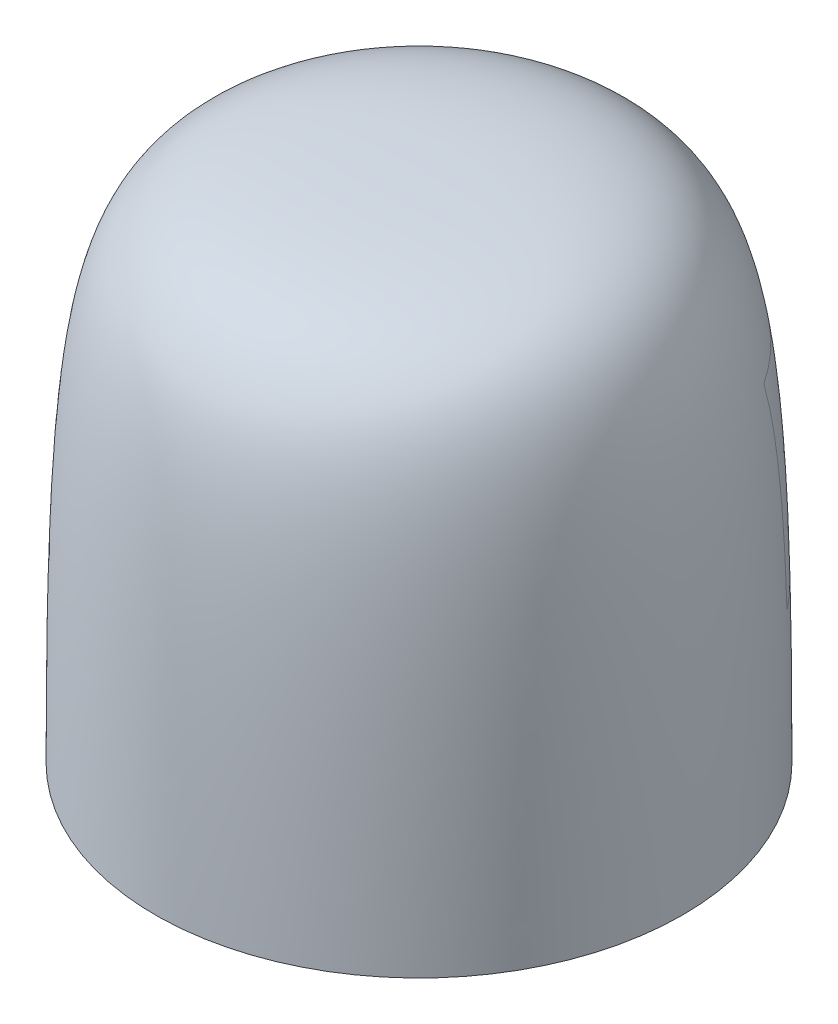
ISO-10303-21;
HEADER;
FILE_DESCRIPTION(('STEP AP214'),'2;1');
FILE_NAME('part.step','',(''),(''),'','','');
FILE_SCHEMA(('AUTOMOTIVE_DESIGN { 1 0 10303 214 1 1 1 1 }'));
ENDSEC;
DATA;
#1=APPLICATION_CONTEXT('core data for automotive mechanical design processes');
#2=APPLICATION_PROTOCOL_DEFINITION('international standard','automotive_design',2000,#1);
#3=PRODUCT_CONTEXT('',#1,'mechanical');
#4=PRODUCT('Part','Part','',(#3));
#5=PRODUCT_RELATED_PRODUCT_CATEGORY('part','',(#4));
#6=PRODUCT_DEFINITION_FORMATION('','',#4);
#7=PRODUCT_DEFINITION_CONTEXT('part definition',#1,'design');
#8=PRODUCT_DEFINITION('design','',#6,#7);
#9=PRODUCT_DEFINITION_SHAPE('','',#8);
#10=(LENGTH_UNIT() NAMED_UNIT(*) SI_UNIT(.MILLI.,.METRE.));
#11=(NAMED_UNIT(*) PLANE_ANGLE_UNIT() SI_UNIT($,.RADIAN.));
#12=(NAMED_UNIT(*) SI_UNIT($,.STERADIAN.) SOLID_ANGLE_UNIT());
#13=UNCERTAINTY_MEASURE_WITH_UNIT(LENGTH_MEASURE(1.E-05),#10,'distance_accuracy_value','');
#14=(GEOMETRIC_REPRESENTATION_CONTEXT(3) GLOBAL_UNCERTAINTY_ASSIGNED_CONTEXT((#13)) GLOBAL_UNIT_ASSIGNED_CONTEXT((#10,
#11,#12)) REPRESENTATION_CONTEXT('',''));
#15=CARTESIAN_POINT('',(0.,0.,0.));
#16=DIRECTION('',(0.,0.,1.));
#17=DIRECTION('',(1.,0.,0.));
#18=AXIS2_PLACEMENT_3D('',#15,#16,#17);
#19=CARTESIAN_POINT('',(0.,50.,0.));
#20=CARTESIAN_POINT('',(25.4,50.,0.));
#21=CARTESIAN_POINT('',(25.4,0.,0.));
#22=(BOUNDED_CURVE() B_SPLINE_CURVE(2,(#19,#20,#21),.UNSPECIFIED.,.F.,
.F.) B_SPLINE_CURVE_WITH_KNOTS((3,3),(0.,1.),
.UNSPECIFIED.) CURVE() GEOMETRIC_REPRESENTATION_ITEM() RATIONAL_B_SPLINE_CURVE((1.,
2.47502696889571,1.)) REPRESENTATION_ITEM(''));
#23=CARTESIAN_POINT('',(0.,0.,0.));
#24=DIRECTION('',(0.,-1.,0.));
#25=AXIS1_PLACEMENT('',#23,#24);
#26=SURFACE_OF_REVOLUTION('',#22,#25);
#27=CARTESIAN_POINT('',(0.,50.,0.));
#28=VERTEX_POINT('',#27);
#29=VERTEX_LOOP('',#28);
#30=FACE_BOUND('',#29,.T.);
#31=CARTESIAN_POINT('',(0.,0.,0.));
#32=DIRECTION('',(0.,-1.,0.));
#33=DIRECTION('',(0.,0.,-1.));
#34=AXIS2_PLACEMENT_3D('',#31,#32,#33);
#35=CIRCLE('',#34,25.4);
#36=CARTESIAN_POINT('',(0.,0.,-25.4));
#37=VERTEX_POINT('',#36);
#38=EDGE_CURVE('E78',#37,#37,#35,.T.);
#39=ORIENTED_EDGE('',*,*,#38,.F.);
#40=EDGE_LOOP('',(#39));
#41=FACE_BOUND('',#40,.T.);
#42=CARTESIAN_POINT('',(-20.,15.,-15.4477518705126));
#43=CARTESIAN_POINT('',(-20.,15.5609498129172,-15.4289699253339));
#44=CARTESIAN_POINT('',(-20.,16.12184793648,-15.4085168354005));
#45=CARTESIAN_POINT('',(-20.,17.2428887497305,-15.363715607829));
#46=CARTESIAN_POINT('',(-20.,17.8030316070898,-15.3393716477059));
#47=CARTESIAN_POINT('',(-20.,18.9225318494632,-15.2862255977604));
#48=CARTESIAN_POINT('',(-20.,19.4818894506108,-15.2574281089941));
#49=CARTESIAN_POINT('',(-20.,20.5997780633631,-15.1946581198859));
#50=CARTESIAN_POINT('',(-20.,21.1583093530604,-15.1606906125982));
#51=CARTESIAN_POINT('',(-20.,22.2744965185269,-15.0867082642588));
#52=CARTESIAN_POINT('',(-20.,22.832152734656,-15.0466986043845));
#53=CARTESIAN_POINT('',(-20.,23.9465295536007,-14.9595452004597));
#54=CARTESIAN_POINT('',(-20.,24.503250535296,-14.9124063475008));
#55=CARTESIAN_POINT('',(-20.,25.6168674482468,-14.8095169735343));
#56=CARTESIAN_POINT('',(-20.,26.1737620398988,-14.7537518114479));
#57=CARTESIAN_POINT('',(-20.,27.2863912345675,-14.631929154367));
#58=CARTESIAN_POINT('',(-20.,27.8421259300257,-14.5658725140112));
#59=CARTESIAN_POINT('',(-20.,28.9520661288805,-14.4212117672557));
#60=CARTESIAN_POINT('',(-20.,29.506271370047,-14.3426056305133));
#61=CARTESIAN_POINT('',(-20.,30.6127064402216,-14.1698937749335));
#62=CARTESIAN_POINT('',(-20.,31.1649346272592,-14.0757773142097));
#63=CARTESIAN_POINT('',(-20.,31.9910432409819,-13.9200327282164));
#64=CARTESIAN_POINT('',(-20.,32.2662911565409,-13.8656331229772));
#65=CARTESIAN_POINT('',(-20.,32.815646017204,-13.7513846928676));
#66=CARTESIAN_POINT('',(-20.,33.0897530141545,-13.6915361185041));
#67=CARTESIAN_POINT('',(-20.,33.6376055822142,-13.5654816016977));
#68=CARTESIAN_POINT('',(-20.,33.9113458341175,-13.4992523952278));
#69=CARTESIAN_POINT('',(-20.,34.4570847899595,-13.3598077295058));
#70=CARTESIAN_POINT('',(-20.,34.7290832025725,-13.2865911325676));
#71=CARTESIAN_POINT('',(-20.,35.,-13.209480899361));
#72=B_SPLINE_CURVE_WITH_KNOTS('',3,(#42,#43,#44,#45,#46,#47,#48,#49,#50,#51,#52,#53,#54,#55,#56,
#57,#58,#59,#60,#61,#62,#63,#64,#65,#66,#67,#68,#69,#70,#71),.UNSPECIFIED.,.F.,.F.,(4,2,2,2,2,2,
2,2,2,2,2,2,2,2,4),(0.,1.68379632077419,3.36579679457697,5.04607101774457,6.72473265846417,
8.40196292690612,10.0780476825357,11.7570090487128,13.4358310625781,15.1149249634185,
16.7951866686561,17.636858145567,18.4784909476178,19.3233177113435,20.1682822651077),.UNSPECIFIED.);
#73=CARTESIAN_POINT('',(-20.,15.,-15.4477518705126));
#74=VERTEX_POINT('',#73);
#75=CARTESIAN_POINT('',(-20.,35.,-13.209480899361));
#76=VERTEX_POINT('',#75);
#77=EDGE_CURVE('E11',#74,#76,#72,.T.);
#78=ORIENTED_EDGE('',*,*,#77,.F.);
#79=CARTESIAN_POINT('',(0.,15.,0.));
#80=DIRECTION('',(0.,-1.,0.));
#81=DIRECTION('',(0.,0.,-1.));
#82=AXIS2_PLACEMENT_3D('',#79,#80,#81);
#83=CIRCLE('',#82,25.2711898780593);
#84=CARTESIAN_POINT('',(20.,15.,-15.4477518705125));
#85=VERTEX_POINT('',#84);
#86=EDGE_CURVE('E98',#74,#85,#83,.T.);
#87=ORIENTED_EDGE('',*,*,#86,.T.);
#88=CARTESIAN_POINT('',(20.,15.,-15.4477518705125));
#89=CARTESIAN_POINT('',(20.,15.5609498129172,-15.4289699253338));
#90=CARTESIAN_POINT('',(20.,16.12184793648,-15.4085168354005));
#91=CARTESIAN_POINT('',(20.,17.2428887497305,-15.363715607829));
#92=CARTESIAN_POINT('',(20.,17.8030316070898,-15.3393716477059));
#93=CARTESIAN_POINT('',(20.,18.9225318494632,-15.2862255977604));
#94=CARTESIAN_POINT('',(20.,19.4818894506109,-15.2574281089941));
#95=CARTESIAN_POINT('',(20.,20.5997780633631,-15.1946581198859));
#96=CARTESIAN_POINT('',(20.,21.1583093530604,-15.1606906125982));
#97=CARTESIAN_POINT('',(20.,22.274496518527,-15.0867082642588));
#98=CARTESIAN_POINT('',(20.,22.8321527346561,-15.0466986043845));
#99=CARTESIAN_POINT('',(20.,23.9465295536007,-14.9595452004597));
#100=CARTESIAN_POINT('',(20.,24.503250535296,-14.9124063475008));
#101=CARTESIAN_POINT('',(20.,25.6168674482468,-14.8095169735343));
#102=CARTESIAN_POINT('',(20.,26.1737620398989,-14.7537518114479));
#103=CARTESIAN_POINT('',(20.,27.2863912345675,-14.631929154367));
#104=CARTESIAN_POINT('',(20.,27.8421259300257,-14.5658725140112));
#105=CARTESIAN_POINT('',(20.,28.9520661288806,-14.4212117672557));
#106=CARTESIAN_POINT('',(20.,29.506271370047,-14.3426056305133));
#107=CARTESIAN_POINT('',(20.,30.6127064402217,-14.1698937749335));
#108=CARTESIAN_POINT('',(20.,31.1649346272593,-14.0757773142097));
#109=CARTESIAN_POINT('',(20.,31.991043240982,-13.9200327282164));
#110=CARTESIAN_POINT('',(20.,32.266291156541,-13.8656331229772));
#111=CARTESIAN_POINT('',(20.,32.815646017204,-13.7513846928676));
#112=CARTESIAN_POINT('',(20.,33.0897530141545,-13.6915361185041));
#113=CARTESIAN_POINT('',(20.,33.6376055822142,-13.5654816016977));
#114=CARTESIAN_POINT('',(20.,33.9113458341175,-13.4992523952278));
#115=CARTESIAN_POINT('',(20.,34.4570847899596,-13.3598077295058));
#116=CARTESIAN_POINT('',(20.,34.7290832025725,-13.2865911325676));
#117=CARTESIAN_POINT('',(20.,35.,-13.209480899361));
#118=B_SPLINE_CURVE_WITH_KNOTS('',3,(#88,#89,#90,#91,#92,#93,#94,#95,#96,#97,#98,#99,#100,#101,
#102,#103,#104,#105,#106,#107,#108,#109,#110,#111,#112,#113,#114,#115,#116,#117),.UNSPECIFIED.,
.F.,.F.,(4,2,2,2,2,2,2,2,2,2,2,2,2,2,4),(0.,1.6837963207742,3.36579679457698,5.04607101774458,
6.72473265846418,8.40196292690615,10.0780476825357,11.7570090487128,13.4358310625781,
15.1149249634185,16.7951866686561,17.636858145567,18.4784909476178,19.3233177113435,
20.1682822651077),.UNSPECIFIED.);
#119=CARTESIAN_POINT('',(20.,35.,-13.209480899361));
#120=VERTEX_POINT('',#119);
#121=EDGE_CURVE('E84',#85,#120,#118,.T.);
#122=ORIENTED_EDGE('',*,*,#121,.T.);
#123=CARTESIAN_POINT('',(0.,35.,0.));
#124=DIRECTION('',(0.,-1.,0.));
#125=DIRECTION('',(0.,0.,-1.));
#126=AXIS2_PLACEMENT_3D('',#123,#124,#125);
#127=CIRCLE('',#126,23.9685290668948);
#128=EDGE_CURVE('E55',#76,#120,#127,.T.);
#129=ORIENTED_EDGE('',*,*,#128,.F.);
#130=EDGE_LOOP('',(#78,#87,#122,#129));
#131=FACE_BOUND('',#130,.T.);
#132=ADVANCED_FACE('F41',(#30,#41,#131),#26,.T.);
#133=CARTESIAN_POINT('',(3.,46.9672838274929,0.));
#134=CARTESIAN_POINT('',(4.02344390639247,46.943533238176,0.));
#135=CARTESIAN_POINT('',(4.93632588335481,46.9079094388946,0.));
#136=CARTESIAN_POINT('',(6.59588368617789,46.8178531533398,0.));
#137=CARTESIAN_POINT('',(7.34228633851941,46.7633960381855,0.));
#138=CARTESIAN_POINT('',(9.38772744348323,46.5770524228691,0.));
#139=CARTESIAN_POINT('',(10.496009256574,46.4223921282968,0.));
#140=CARTESIAN_POINT('',(12.3851107549658,46.0719007800842,0.));
#141=CARTESIAN_POINT('',(13.1637477518602,45.8759799757563,0.));
#142=CARTESIAN_POINT('',(14.4956220084948,45.4566030630922,0.));
#143=CARTESIAN_POINT('',(15.0478823054313,45.2333446828987,0.));
#144=CARTESIAN_POINT('',(16.0004693175497,44.7658874857519,0.));
#145=CARTESIAN_POINT('',(16.4006304686482,44.5219496876816,0.));
#146=CARTESIAN_POINT('',(17.1099573791476,44.0045367860883,0.));
#147=CARTESIAN_POINT('',(17.4194011252677,43.7309135761532,0.));
#148=CARTESIAN_POINT('',(17.991987531108,43.1269979557137,0.));
#149=CARTESIAN_POINT('',(18.2551265804886,42.7962600392364,0.));
#150=CARTESIAN_POINT('',(18.7568922048879,42.0427001557068,0.));
#151=CARTESIAN_POINT('',(18.9951698709722,41.6197303032028,0.));
#152=CARTESIAN_POINT('',(19.6804169399592,40.1634675227639,0.));
#153=CARTESIAN_POINT('',(20.0971479628446,38.9469832862305,0.));
#154=CARTESIAN_POINT('',(20.6542458615251,36.5440782561036,0.));
#155=CARTESIAN_POINT('',(20.8285428025501,35.6461422290099,0.));
#156=CARTESIAN_POINT('',(21.1533552180572,33.5992305690156,0.));
#157=CARTESIAN_POINT('',(21.3038980886096,32.450864550997,0.));
#158=CARTESIAN_POINT('',(21.5803717510384,29.8145495901929,0.));
#159=CARTESIAN_POINT('',(21.7063413867351,28.327749097822,0.));
#160=CARTESIAN_POINT('',(21.8755544770169,25.7336621928842,0.));
#161=CARTESIAN_POINT('',(21.9286583275309,24.8077772688522,0.));
#162=CARTESIAN_POINT('',(22.0278466668586,22.805963119594,0.));
#163=CARTESIAN_POINT('',(22.0739339055053,21.7301478422194,0.));
#164=CARTESIAN_POINT('',(22.1584615053982,19.3915533069622,0.));
#165=CARTESIAN_POINT('',(22.1969060401828,18.1289533813778,0.));
#166=CARTESIAN_POINT('',(22.2652065642525,15.3661860419958,0.));
#167=CARTESIAN_POINT('',(22.2950692548689,13.8663115726337,0.));
#168=CARTESIAN_POINT('',(22.3447922012268,10.5578448902982,0.));
#169=CARTESIAN_POINT('',(22.3646638103908,8.74975265817107,0.));
#170=CARTESIAN_POINT('',(22.392257527116,4.72169388084097,0.));
#171=CARTESIAN_POINT('',(22.4,2.50262671062518,0.));
#172=CARTESIAN_POINT('',(22.4,0.,0.));
#173=B_SPLINE_CURVE_WITH_KNOTS('',3,(#133,#134,#135,#136,#137,#138,#139,#140,#141,#142,#143,
#144,#145,#146,#147,#148,#149,#150,#151,#152,#153,#154,#155,#156,#157,#158,#159,#160,#161,#162,
#163,#164,#165,#166,#167,#168,#169,#170,#171,#172),.UNSPECIFIED.,.F.,.F.,(4,2,2,2,2,2,2,2,2,2,2,
2,2,2,2,2,2,2,2,4),(0.,0.0312499999999999,0.0624999999999998,0.125,0.187499999999999,
0.249999999999999,0.312499999999999,0.374999999999999,0.437499999999999,0.499999999999999,
0.624999999999999,0.687499999999999,0.749999999999999,0.812499999999999,0.843749999999999,
0.874999999999999,0.906249999999999,0.9375,0.96875,1.),.UNSPECIFIED.);
#174=CARTESIAN_POINT('',(0.,0.,0.));
#175=DIRECTION('',(0.,-1.,0.));
#176=AXIS1_PLACEMENT('',#174,#175);
#177=SURFACE_OF_REVOLUTION('',#173,#176);
#178=CARTESIAN_POINT('',(0.,0.,0.));
#179=DIRECTION('',(0.,-1.,0.));
#180=DIRECTION('',(0.,0.,-1.));
#181=AXIS2_PLACEMENT_3D('',#178,#179,#180);
#182=CIRCLE('',#181,22.4);
#183=CARTESIAN_POINT('',(0.,0.,-22.4));
#184=VERTEX_POINT('',#183);
#185=EDGE_CURVE('E80',#184,#184,#182,.T.);
#186=ORIENTED_EDGE('',*,*,#185,.T.);
#187=EDGE_LOOP('',(#186));
#188=FACE_BOUND('',#187,.T.);
#189=CARTESIAN_POINT('',(0.,46.9672838274929,0.));
#190=DIRECTION('',(0.,-1.,0.));
#191=DIRECTION('',(0.,0.,-1.));
#192=AXIS2_PLACEMENT_3D('',#189,#190,#191);
#193=CIRCLE('',#192,3.);
#194=CARTESIAN_POINT('',(0.,46.9672838274929,-3.));
#195=VERTEX_POINT('',#194);
#196=EDGE_CURVE('E87',#195,#195,#193,.T.);
#197=ORIENTED_EDGE('',*,*,#196,.F.);
#198=EDGE_LOOP('',(#197));
#199=FACE_BOUND('',#198,.T.);
#200=ADVANCED_FACE('F74',(#188,#199),#177,.F.);
#201=CARTESIAN_POINT('',(25.4,0.,0.));
#202=DIRECTION('',(0.,1.,0.));
#203=DIRECTION('',(0.,0.,1.));
#204=AXIS2_PLACEMENT_3D('',#201,#202,#203);
#205=PLANE('',#204);
#206=ORIENTED_EDGE('',*,*,#185,.F.);
#207=EDGE_LOOP('',(#206));
#208=FACE_BOUND('',#207,.T.);
#209=ORIENTED_EDGE('',*,*,#38,.T.);
#210=EDGE_LOOP('',(#209));
#211=FACE_BOUND('',#210,.T.);
#212=ADVANCED_FACE('F105',(#208,#211),#205,.F.);
#213=ORIENTED_EDGE('',*,*,#86,.F.);
#214=ORIENTED_EDGE('',*,*,#77,.T.);
#215=ORIENTED_EDGE('',*,*,#128,.T.);
#216=ORIENTED_EDGE('',*,*,#121,.F.);
#217=EDGE_LOOP('',(#213,#214,#215,#216));
#218=FACE_BOUND('',#217,.T.);
#219=ADVANCED_FACE('F75',(#218),#26,.T.);
#220=CARTESIAN_POINT('',(3.,0.,0.));
#221=DIRECTION('',(0.,1.,0.));
#222=DIRECTION('',(0.,0.,1.));
#223=AXIS2_PLACEMENT_3D('',#220,#221,#222);
#224=PLANE('',#223);
#225=CARTESIAN_POINT('',(0.,0.,0.));
#226=DIRECTION('',(0.,-1.,0.));
#227=DIRECTION('',(0.,0.,-1.));
#228=AXIS2_PLACEMENT_3D('',#225,#226,#227);
#229=CIRCLE('',#228,3.);
#230=CARTESIAN_POINT('',(0.,0.,-3.));
#231=VERTEX_POINT('',#230);
#232=EDGE_CURVE('E81',#231,#231,#229,.T.);
#233=ORIENTED_EDGE('',*,*,#232,.T.);
#234=EDGE_LOOP('',(#233));
#235=FACE_BOUND('',#234,.T.);
#236=ADVANCED_FACE('F104',(#235),#224,.F.);
#237=CARTESIAN_POINT('',(0.,0.,0.));
#238=DIRECTION('',(0.,-1.,0.));
#239=DIRECTION('',(0.,0.,-1.));
#240=AXIS2_PLACEMENT_3D('',#237,#238,#239);
#241=CYLINDRICAL_SURFACE('',#240,3.);
#242=ORIENTED_EDGE('',*,*,#196,.T.);
#243=EDGE_LOOP('',(#242));
#244=FACE_BOUND('',#243,.T.);
#245=ORIENTED_EDGE('',*,*,#232,.F.);
#246=EDGE_LOOP('',(#245));
#247=FACE_BOUND('',#246,.T.);
#248=ADVANCED_FACE('F122',(#244,#247),#241,.T.);
#249=CLOSED_SHELL('',(#132,#200,#212,#219,#236,#248));
#250=MANIFOLD_SOLID_BREP('B2',#249);
#251=ADVANCED_BREP_SHAPE_REPRESENTATION('',(#18,#250),#14);
#252=SHAPE_DEFINITION_REPRESENTATION(#9,#251);
ENDSEC;
END-ISO-10303-21;
